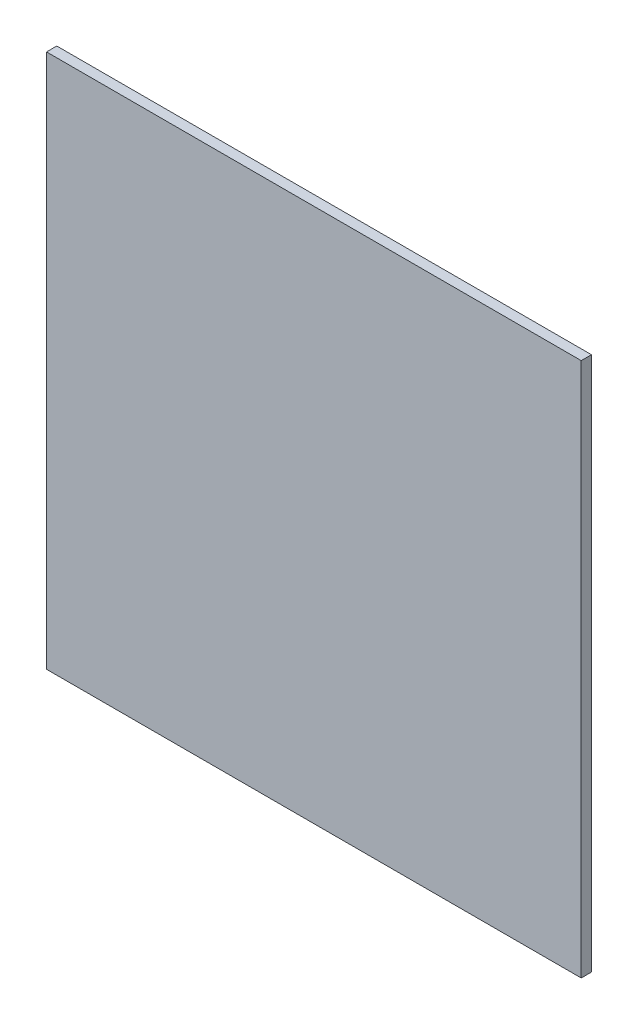
ISO-10303-21;
HEADER;
FILE_DESCRIPTION(('STEP AP214'),'2;1');
FILE_NAME('part.step','',(''),(''),'','','');
FILE_SCHEMA(('AUTOMOTIVE_DESIGN { 1 0 10303 214 1 1 1 1 }'));
ENDSEC;
DATA;
#1=APPLICATION_CONTEXT('core data for automotive mechanical design processes');
#2=APPLICATION_PROTOCOL_DEFINITION('international standard','automotive_design',2000,#1);
#3=PRODUCT_CONTEXT('',#1,'mechanical');
#4=PRODUCT('Part','Part','',(#3));
#5=PRODUCT_RELATED_PRODUCT_CATEGORY('part','',(#4));
#6=PRODUCT_DEFINITION_FORMATION('','',#4);
#7=PRODUCT_DEFINITION_CONTEXT('part definition',#1,'design');
#8=PRODUCT_DEFINITION('design','',#6,#7);
#9=PRODUCT_DEFINITION_SHAPE('','',#8);
#10=(LENGTH_UNIT() NAMED_UNIT(*) SI_UNIT(.MILLI.,.METRE.));
#11=(NAMED_UNIT(*) PLANE_ANGLE_UNIT() SI_UNIT($,.RADIAN.));
#12=(NAMED_UNIT(*) SI_UNIT($,.STERADIAN.) SOLID_ANGLE_UNIT());
#13=UNCERTAINTY_MEASURE_WITH_UNIT(LENGTH_MEASURE(1.E-05),#10,'distance_accuracy_value','');
#14=(GEOMETRIC_REPRESENTATION_CONTEXT(3) GLOBAL_UNCERTAINTY_ASSIGNED_CONTEXT((#13)) GLOBAL_UNIT_ASSIGNED_CONTEXT((#10,
#11,#12)) REPRESENTATION_CONTEXT('',''));
#15=CARTESIAN_POINT('',(0.,0.,0.));
#16=DIRECTION('',(0.,0.,1.));
#17=DIRECTION('',(1.,0.,0.));
#18=AXIS2_PLACEMENT_3D('',#15,#16,#17);
#19=CARTESIAN_POINT('',(0.,0.,-9.));
#20=DIRECTION('',(-1.,0.,0.));
#21=DIRECTION('',(0.,-1.,0.));
#22=AXIS2_PLACEMENT_3D('',#19,#20,#21);
#23=PLANE('',#22);
#24=DIRECTION('',(0.,-1.,0.));
#25=VECTOR('',#24,1.);
#26=CARTESIAN_POINT('',(0.,0.,0.));
#27=LINE('',#26,#25);
#28=CARTESIAN_POINT('',(-1.66533453693773E-13,470.,0.));
#29=VERTEX_POINT('',#28);
#30=CARTESIAN_POINT('',(0.,0.,0.));
#31=VERTEX_POINT('',#30);
#32=EDGE_CURVE('E99',#29,#31,#27,.T.);
#33=ORIENTED_EDGE('',*,*,#32,.F.);
#34=DIRECTION('',(0.,0.,1.));
#35=VECTOR('',#34,1.);
#36=CARTESIAN_POINT('',(-1.66533453693773E-13,470.,-9.));
#37=LINE('',#36,#35);
#38=CARTESIAN_POINT('',(-1.66533453693773E-13,470.,-9.));
#39=VERTEX_POINT('',#38);
#40=EDGE_CURVE('E11',#39,#29,#37,.T.);
#41=ORIENTED_EDGE('',*,*,#40,.F.);
#42=DIRECTION('',(0.,-1.,0.));
#43=VECTOR('',#42,1.);
#44=CARTESIAN_POINT('',(0.,0.,-9.));
#45=LINE('',#44,#43);
#46=CARTESIAN_POINT('',(0.,0.,-9.));
#47=VERTEX_POINT('',#46);
#48=EDGE_CURVE('E93',#39,#47,#45,.T.);
#49=ORIENTED_EDGE('',*,*,#48,.T.);
#50=DIRECTION('',(0.,0.,1.));
#51=VECTOR('',#50,1.);
#52=CARTESIAN_POINT('',(0.,0.,-9.));
#53=LINE('',#52,#51);
#54=EDGE_CURVE('E38',#47,#31,#53,.T.);
#55=ORIENTED_EDGE('',*,*,#54,.T.);
#56=EDGE_LOOP('',(#33,#41,#49,#55));
#57=FACE_BOUND('',#56,.T.);
#58=ADVANCED_FACE('F35',(#57),#23,.T.);
#59=CARTESIAN_POINT('',(-1.66533453693773E-13,470.,-9.));
#60=DIRECTION('',(0.,1.,0.));
#61=DIRECTION('',(0.,0.,1.));
#62=AXIS2_PLACEMENT_3D('',#59,#60,#61);
#63=PLANE('',#62);
#64=DIRECTION('',(-1.,0.,0.));
#65=VECTOR('',#64,1.);
#66=CARTESIAN_POINT('',(-1.66533453693773E-13,470.,0.));
#67=LINE('',#66,#65);
#68=CARTESIAN_POINT('',(470.,470.,0.));
#69=VERTEX_POINT('',#68);
#70=EDGE_CURVE('E95',#69,#29,#67,.T.);
#71=ORIENTED_EDGE('',*,*,#70,.F.);
#72=DIRECTION('',(0.,0.,1.));
#73=VECTOR('',#72,1.);
#74=CARTESIAN_POINT('',(470.,470.,-9.));
#75=LINE('',#74,#73);
#76=CARTESIAN_POINT('',(470.,470.,-9.));
#77=VERTEX_POINT('',#76);
#78=EDGE_CURVE('E44',#77,#69,#75,.T.);
#79=ORIENTED_EDGE('',*,*,#78,.F.);
#80=DIRECTION('',(-1.,0.,0.));
#81=VECTOR('',#80,1.);
#82=CARTESIAN_POINT('',(-1.66533453693773E-13,470.,-9.));
#83=LINE('',#82,#81);
#84=EDGE_CURVE('E90',#77,#39,#83,.T.);
#85=ORIENTED_EDGE('',*,*,#84,.T.);
#86=ORIENTED_EDGE('',*,*,#40,.T.);
#87=EDGE_LOOP('',(#71,#79,#85,#86));
#88=FACE_BOUND('',#87,.T.);
#89=ADVANCED_FACE('F109',(#88),#63,.T.);
#90=CARTESIAN_POINT('',(470.,0.,-9.));
#91=DIRECTION('',(1.,0.,0.));
#92=DIRECTION('',(0.,1.,0.));
#93=AXIS2_PLACEMENT_3D('',#90,#91,#92);
#94=PLANE('',#93);
#95=DIRECTION('',(0.,1.,0.));
#96=VECTOR('',#95,1.);
#97=CARTESIAN_POINT('',(470.,0.,0.));
#98=LINE('',#97,#96);
#99=CARTESIAN_POINT('',(470.,0.,0.));
#100=VERTEX_POINT('',#99);
#101=EDGE_CURVE('E85',#100,#69,#98,.T.);
#102=ORIENTED_EDGE('',*,*,#101,.F.);
#103=DIRECTION('',(0.,0.,1.));
#104=VECTOR('',#103,1.);
#105=CARTESIAN_POINT('',(470.,0.,-9.));
#106=LINE('',#105,#104);
#107=CARTESIAN_POINT('',(470.,0.,-9.));
#108=VERTEX_POINT('',#107);
#109=EDGE_CURVE('E80',#108,#100,#106,.T.);
#110=ORIENTED_EDGE('',*,*,#109,.F.);
#111=DIRECTION('',(0.,1.,0.));
#112=VECTOR('',#111,1.);
#113=CARTESIAN_POINT('',(470.,0.,-9.));
#114=LINE('',#113,#112);
#115=EDGE_CURVE('E83',#108,#77,#114,.T.);
#116=ORIENTED_EDGE('',*,*,#115,.T.);
#117=ORIENTED_EDGE('',*,*,#78,.T.);
#118=EDGE_LOOP('',(#102,#110,#116,#117));
#119=FACE_BOUND('',#118,.T.);
#120=ADVANCED_FACE('F82',(#119),#94,.T.);
#121=CARTESIAN_POINT('',(0.,0.,-9.));
#122=DIRECTION('',(0.,-1.,0.));
#123=DIRECTION('',(0.,0.,-1.));
#124=AXIS2_PLACEMENT_3D('',#121,#122,#123);
#125=PLANE('',#124);
#126=DIRECTION('',(1.,0.,0.));
#127=VECTOR('',#126,1.);
#128=CARTESIAN_POINT('',(0.,0.,0.));
#129=LINE('',#128,#127);
#130=EDGE_CURVE('E102',#31,#100,#129,.T.);
#131=ORIENTED_EDGE('',*,*,#130,.F.);
#132=ORIENTED_EDGE('',*,*,#54,.F.);
#133=DIRECTION('',(1.,0.,0.));
#134=VECTOR('',#133,1.);
#135=CARTESIAN_POINT('',(0.,0.,-9.));
#136=LINE('',#135,#134);
#137=EDGE_CURVE('E89',#47,#108,#136,.T.);
#138=ORIENTED_EDGE('',*,*,#137,.T.);
#139=ORIENTED_EDGE('',*,*,#109,.T.);
#140=EDGE_LOOP('',(#131,#132,#138,#139));
#141=FACE_BOUND('',#140,.T.);
#142=ADVANCED_FACE('F92',(#141),#125,.T.);
#143=CARTESIAN_POINT('',(0.,0.,-9.));
#144=DIRECTION('',(0.,0.,-1.));
#145=DIRECTION('',(-1.,0.,0.));
#146=AXIS2_PLACEMENT_3D('',#143,#144,#145);
#147=PLANE('',#146);
#148=ORIENTED_EDGE('',*,*,#48,.F.);
#149=ORIENTED_EDGE('',*,*,#84,.F.);
#150=ORIENTED_EDGE('',*,*,#115,.F.);
#151=ORIENTED_EDGE('',*,*,#137,.F.);
#152=EDGE_LOOP('',(#148,#149,#150,#151));
#153=FACE_BOUND('',#152,.T.);
#154=ADVANCED_FACE('F88',(#153),#147,.T.);
#155=CARTESIAN_POINT('',(0.,0.,0.));
#156=DIRECTION('',(0.,0.,-1.));
#157=DIRECTION('',(-1.,0.,0.));
#158=AXIS2_PLACEMENT_3D('',#155,#156,#157);
#159=PLANE('',#158);
#160=ORIENTED_EDGE('',*,*,#32,.T.);
#161=ORIENTED_EDGE('',*,*,#130,.T.);
#162=ORIENTED_EDGE('',*,*,#101,.T.);
#163=ORIENTED_EDGE('',*,*,#70,.T.);
#164=EDGE_LOOP('',(#160,#161,#162,#163));
#165=FACE_BOUND('',#164,.T.);
#166=ADVANCED_FACE('F108',(#165),#159,.F.);
#167=CLOSED_SHELL('',(#58,#89,#120,#142,#154,#166));
#168=MANIFOLD_SOLID_BREP('B2',#167);
#169=ADVANCED_BREP_SHAPE_REPRESENTATION('',(#18,#168),#14);
#170=SHAPE_DEFINITION_REPRESENTATION(#9,#169);
ENDSEC;
END-ISO-10303-21;
